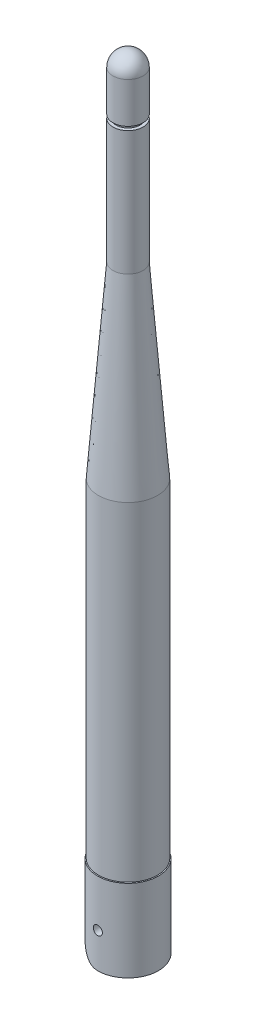
ISO-10303-21;
HEADER;
FILE_DESCRIPTION(('STEP AP214'),'2;1');
FILE_NAME('part.step','',(''),(''),'','','');
FILE_SCHEMA(('AUTOMOTIVE_DESIGN { 1 0 10303 214 1 1 1 1 }'));
ENDSEC;
DATA;
#1=APPLICATION_CONTEXT('core data for automotive mechanical design processes');
#2=APPLICATION_PROTOCOL_DEFINITION('international standard','automotive_design',2000,#1);
#3=PRODUCT_CONTEXT('',#1,'mechanical');
#4=PRODUCT('Part','Part','',(#3));
#5=PRODUCT_RELATED_PRODUCT_CATEGORY('part','',(#4));
#6=PRODUCT_DEFINITION_FORMATION('','',#4);
#7=PRODUCT_DEFINITION_CONTEXT('part definition',#1,'design');
#8=PRODUCT_DEFINITION('design','',#6,#7);
#9=PRODUCT_DEFINITION_SHAPE('','',#8);
#10=(LENGTH_UNIT() NAMED_UNIT(*) SI_UNIT(.MILLI.,.METRE.));
#11=(NAMED_UNIT(*) PLANE_ANGLE_UNIT() SI_UNIT($,.RADIAN.));
#12=(NAMED_UNIT(*) SI_UNIT($,.STERADIAN.) SOLID_ANGLE_UNIT());
#13=UNCERTAINTY_MEASURE_WITH_UNIT(LENGTH_MEASURE(1.E-05),#10,'distance_accuracy_value','');
#14=(GEOMETRIC_REPRESENTATION_CONTEXT(3) GLOBAL_UNCERTAINTY_ASSIGNED_CONTEXT((#13)) GLOBAL_UNIT_ASSIGNED_CONTEXT((#10,
#11,#12)) REPRESENTATION_CONTEXT('',''));
#15=CARTESIAN_POINT('',(0.,0.,0.));
#16=DIRECTION('',(0.,0.,1.));
#17=DIRECTION('',(1.,0.,0.));
#18=AXIS2_PLACEMENT_3D('',#15,#16,#17);
#19=CARTESIAN_POINT('',(6.73734999999998,169.81455,0.));
#20=DIRECTION('',(0.,-1.,0.));
#21=DIRECTION('',(1.,0.,0.));
#22=AXIS2_PLACEMENT_3D('',#19,#20,#21);
#23=SPHERICAL_SURFACE('',#22,3.33375000000006);
#24=CARTESIAN_POINT('',(6.73734999999998,169.81455,0.));
#25=DIRECTION('',(0.,-1.,0.));
#26=DIRECTION('',(1.,0.,0.));
#27=AXIS2_PLACEMENT_3D('',#24,#25,#26);
#28=CIRCLE('',#27,3.33375000000002);
#29=CARTESIAN_POINT('',(10.0711,169.81455,0.));
#30=VERTEX_POINT('',#29);
#31=EDGE_CURVE('E11',#30,#30,#28,.T.);
#32=ORIENTED_EDGE('',*,*,#31,.F.);
#33=EDGE_LOOP('',(#32));
#34=FACE_BOUND('',#33,.T.);
#35=ADVANCED_FACE('F47',(#34),#23,.T.);
#36=CARTESIAN_POINT('',(6.73735,18.1483,0.));
#37=DIRECTION('',(0.,-1.,0.));
#38=DIRECTION('',(1.,0.,0.));
#39=AXIS2_PLACEMENT_3D('',#36,#37,#38);
#40=CYLINDRICAL_SURFACE('',#39,3.33375000000002);
#41=ORIENTED_EDGE('',*,*,#31,.T.);
#42=EDGE_LOOP('',(#41));
#43=FACE_BOUND('',#42,.T.);
#44=CARTESIAN_POINT('',(6.73734999999998,160.8293,0.));
#45=DIRECTION('',(0.,-1.,0.));
#46=DIRECTION('',(1.,0.,0.));
#47=AXIS2_PLACEMENT_3D('',#44,#45,#46);
#48=CIRCLE('',#47,3.33375000000002);
#49=CARTESIAN_POINT('',(10.0711,160.8293,0.));
#50=VERTEX_POINT('',#49);
#51=EDGE_CURVE('E53',#50,#50,#48,.T.);
#52=ORIENTED_EDGE('',*,*,#51,.F.);
#53=EDGE_LOOP('',(#52));
#54=FACE_BOUND('',#53,.T.);
#55=ADVANCED_FACE('F101',(#43,#54),#40,.T.);
#56=CARTESIAN_POINT('',(10.0711,160.8293,0.));
#57=DIRECTION('',(0.,-1.,0.));
#58=DIRECTION('',(1.,0.,0.));
#59=AXIS2_PLACEMENT_3D('',#56,#57,#58);
#60=PLANE('',#59);
#61=ORIENTED_EDGE('',*,*,#51,.T.);
#62=EDGE_LOOP('',(#61));
#63=FACE_BOUND('',#62,.T.);
#64=CARTESIAN_POINT('',(6.73734999999998,160.8293,0.));
#65=DIRECTION('',(0.,-1.,0.));
#66=DIRECTION('',(1.,0.,0.));
#67=AXIS2_PLACEMENT_3D('',#64,#65,#66);
#68=CIRCLE('',#67,2.62890000000002);
#69=CARTESIAN_POINT('',(9.36625,160.8293,0.));
#70=VERTEX_POINT('',#69);
#71=EDGE_CURVE('E57',#70,#70,#68,.T.);
#72=ORIENTED_EDGE('',*,*,#71,.F.);
#73=EDGE_LOOP('',(#72));
#74=FACE_BOUND('',#73,.T.);
#75=ADVANCED_FACE('F106',(#63,#74),#60,.T.);
#76=CARTESIAN_POINT('',(6.73735,18.1483,0.));
#77=DIRECTION('',(0.,-1.,0.));
#78=DIRECTION('',(1.,0.,0.));
#79=AXIS2_PLACEMENT_3D('',#76,#77,#78);
#80=CYLINDRICAL_SURFACE('',#79,2.62890000000002);
#81=ORIENTED_EDGE('',*,*,#71,.T.);
#82=EDGE_LOOP('',(#81));
#83=FACE_BOUND('',#82,.T.);
#84=CARTESIAN_POINT('',(6.73734999999998,160.0165,0.));
#85=DIRECTION('',(0.,-1.,0.));
#86=DIRECTION('',(1.,0.,0.));
#87=AXIS2_PLACEMENT_3D('',#84,#85,#86);
#88=CIRCLE('',#87,2.62890000000002);
#89=CARTESIAN_POINT('',(9.36625,160.0165,0.));
#90=VERTEX_POINT('',#89);
#91=EDGE_CURVE('E61',#90,#90,#88,.T.);
#92=ORIENTED_EDGE('',*,*,#91,.F.);
#93=EDGE_LOOP('',(#92));
#94=FACE_BOUND('',#93,.T.);
#95=ADVANCED_FACE('F110',(#83,#94),#80,.T.);
#96=CARTESIAN_POINT('',(9.36625,160.0165,0.));
#97=DIRECTION('',(0.,1.,0.));
#98=DIRECTION('',(-1.,0.,0.));
#99=AXIS2_PLACEMENT_3D('',#96,#97,#98);
#100=PLANE('',#99);
#101=ORIENTED_EDGE('',*,*,#91,.T.);
#102=EDGE_LOOP('',(#101));
#103=FACE_BOUND('',#102,.T.);
#104=CARTESIAN_POINT('',(6.73734999999998,160.0165,0.));
#105=DIRECTION('',(0.,-1.,0.));
#106=DIRECTION('',(1.,0.,0.));
#107=AXIS2_PLACEMENT_3D('',#104,#105,#106);
#108=CIRCLE('',#107,3.33375000000002);
#109=CARTESIAN_POINT('',(10.0711,160.0165,0.));
#110=VERTEX_POINT('',#109);
#111=EDGE_CURVE('E66',#110,#110,#108,.T.);
#112=ORIENTED_EDGE('',*,*,#111,.F.);
#113=EDGE_LOOP('',(#112));
#114=FACE_BOUND('',#113,.T.);
#115=ADVANCED_FACE('F116',(#103,#114),#100,.T.);
#116=CARTESIAN_POINT('',(6.73735,18.1483,0.));
#117=DIRECTION('',(0.,-1.,0.));
#118=DIRECTION('',(1.,0.,0.));
#119=AXIS2_PLACEMENT_3D('',#116,#117,#118);
#120=CYLINDRICAL_SURFACE('',#119,3.33375000000002);
#121=ORIENTED_EDGE('',*,*,#111,.T.);
#122=EDGE_LOOP('',(#121));
#123=FACE_BOUND('',#122,.T.);
#124=CARTESIAN_POINT('',(6.73734999999999,132.5083,0.));
#125=DIRECTION('',(0.,-1.,0.));
#126=DIRECTION('',(1.,0.,0.));
#127=AXIS2_PLACEMENT_3D('',#124,#125,#126);
#128=CIRCLE('',#127,3.33375000000002);
#129=CARTESIAN_POINT('',(10.0711,132.5083,0.));
#130=VERTEX_POINT('',#129);
#131=EDGE_CURVE('E69',#130,#130,#128,.T.);
#132=ORIENTED_EDGE('',*,*,#131,.F.);
#133=EDGE_LOOP('',(#132));
#134=FACE_BOUND('',#133,.T.);
#135=ADVANCED_FACE('F120',(#123,#134),#120,.T.);
#136=CARTESIAN_POINT('',(6.73734999999999,90.9955,0.));
#137=DIRECTION('',(0.,-1.,0.));
#138=DIRECTION('',(1.,0.,0.));
#139=AXIS2_PLACEMENT_3D('',#136,#137,#138);
#140=CONICAL_SURFACE('',#139,6.54050000000001,0.0770941580717803);
#141=ORIENTED_EDGE('',*,*,#131,.T.);
#142=EDGE_LOOP('',(#141));
#143=FACE_BOUND('',#142,.T.);
#144=CARTESIAN_POINT('',(6.73734999999999,90.9955,0.));
#145=DIRECTION('',(0.,-1.,0.));
#146=DIRECTION('',(1.,0.,0.));
#147=AXIS2_PLACEMENT_3D('',#144,#145,#146);
#148=CIRCLE('',#147,6.54050000000001);
#149=CARTESIAN_POINT('',(13.27785,90.9955,0.));
#150=VERTEX_POINT('',#149);
#151=EDGE_CURVE('E72',#150,#150,#148,.T.);
#152=ORIENTED_EDGE('',*,*,#151,.F.);
#153=EDGE_LOOP('',(#152));
#154=FACE_BOUND('',#153,.T.);
#155=ADVANCED_FACE('F124',(#143,#154),#140,.T.);
#156=CARTESIAN_POINT('',(6.73735,18.1483,0.));
#157=DIRECTION('',(0.,-1.,0.));
#158=DIRECTION('',(1.,0.,0.));
#159=AXIS2_PLACEMENT_3D('',#156,#157,#158);
#160=CYLINDRICAL_SURFACE('',#159,6.54050000000001);
#161=ORIENTED_EDGE('',*,*,#151,.T.);
#162=EDGE_LOOP('',(#161));
#163=FACE_BOUND('',#162,.T.);
#164=CARTESIAN_POINT('',(6.73735,18.2245,0.));
#165=DIRECTION('',(0.,-1.,0.));
#166=DIRECTION('',(1.,0.,0.));
#167=AXIS2_PLACEMENT_3D('',#164,#165,#166);
#168=CIRCLE('',#167,6.5405);
#169=CARTESIAN_POINT('',(13.27785,18.2245,0.));
#170=VERTEX_POINT('',#169);
#171=EDGE_CURVE('E75',#170,#170,#168,.T.);
#172=ORIENTED_EDGE('',*,*,#171,.F.);
#173=EDGE_LOOP('',(#172));
#174=FACE_BOUND('',#173,.T.);
#175=ADVANCED_FACE('F97',(#163,#174),#160,.T.);
#176=CARTESIAN_POINT('',(13.27785,18.2245,0.));
#177=DIRECTION('',(0.,-1.,0.));
#178=DIRECTION('',(1.,0.,0.));
#179=AXIS2_PLACEMENT_3D('',#176,#177,#178);
#180=PLANE('',#179);
#181=ORIENTED_EDGE('',*,*,#171,.T.);
#182=EDGE_LOOP('',(#181));
#183=FACE_BOUND('',#182,.T.);
#184=CARTESIAN_POINT('',(6.73735,18.2245,0.));
#185=DIRECTION('',(0.,-1.,0.));
#186=DIRECTION('',(1.,0.,0.));
#187=AXIS2_PLACEMENT_3D('',#184,#185,#186);
#188=CIRCLE('',#187,1.42875);
#189=CARTESIAN_POINT('',(8.1661,18.2245,0.));
#190=VERTEX_POINT('',#189);
#191=EDGE_CURVE('E78',#190,#190,#188,.T.);
#192=ORIENTED_EDGE('',*,*,#191,.F.);
#193=EDGE_LOOP('',(#192));
#194=FACE_BOUND('',#193,.T.);
#195=ADVANCED_FACE('F89',(#183,#194),#180,.T.);
#196=CARTESIAN_POINT('',(6.73735,18.1483,0.));
#197=DIRECTION('',(0.,-1.,0.));
#198=DIRECTION('',(1.,0.,0.));
#199=AXIS2_PLACEMENT_3D('',#196,#197,#198);
#200=CYLINDRICAL_SURFACE('',#199,1.42875000000001);
#201=ORIENTED_EDGE('',*,*,#191,.T.);
#202=EDGE_LOOP('',(#201));
#203=FACE_BOUND('',#202,.T.);
#204=CARTESIAN_POINT('',(6.73734999999998,169.81455,0.));
#205=DIRECTION('',(0.,-1.,0.));
#206=DIRECTION('',(1.,0.,0.));
#207=AXIS2_PLACEMENT_3D('',#204,#205,#206);
#208=CIRCLE('',#207,1.42875000000002);
#209=CARTESIAN_POINT('',(8.1661,169.81455,0.));
#210=VERTEX_POINT('',#209);
#211=EDGE_CURVE('E81',#210,#210,#208,.T.);
#212=ORIENTED_EDGE('',*,*,#211,.F.);
#213=EDGE_LOOP('',(#212));
#214=FACE_BOUND('',#213,.T.);
#215=ADVANCED_FACE('F87',(#203,#214),#200,.F.);
#216=CARTESIAN_POINT('',(6.73734999999998,169.81455,0.));
#217=DIRECTION('',(0.,-1.,0.));
#218=DIRECTION('',(1.,0.,0.));
#219=AXIS2_PLACEMENT_3D('',#216,#217,#218);
#220=PLANE('',#219);
#221=ORIENTED_EDGE('',*,*,#211,.T.);
#222=EDGE_LOOP('',(#221));
#223=FACE_BOUND('',#222,.T.);
#224=ADVANCED_FACE('F85',(#223),#220,.T.);
#225=CLOSED_SHELL('',(#35,#55,#75,#95,#115,#135,#155,#175,#195,#215,#224));
#226=MANIFOLD_SOLID_BREP('B2',#225);
#227=CARTESIAN_POINT('',(10.9347,13.7033,-4.43865));
#228=DIRECTION('',(0.,0.,1.));
#229=DIRECTION('',(0.,-1.,0.));
#230=AXIS2_PLACEMENT_3D('',#227,#228,#229);
#231=PLANE('',#230);
#232=CARTESIAN_POINT('',(6.73735,7.747,-4.43865));
#233=DIRECTION('',(0.,0.,1.));
#234=DIRECTION('',(0.,-1.,0.));
#235=AXIS2_PLACEMENT_3D('',#232,#233,#234);
#236=CIRCLE('',#235,1.);
#237=CARTESIAN_POINT('',(6.73735,6.747,-4.43865));
#238=VERTEX_POINT('',#237);
#239=EDGE_CURVE('E333',#238,#238,#236,.F.);
#240=ORIENTED_EDGE('',*,*,#239,.T.);
#241=EDGE_LOOP('',(#240));
#242=FACE_BOUND('',#241,.T.);
#243=DIRECTION('',(0.,-1.,0.));
#244=VECTOR('',#243,1.);
#245=CARTESIAN_POINT('',(1.6688054,13.7033,-4.43865));
#246=LINE('',#245,#244);
#247=CARTESIAN_POINT('',(1.6688054,5.0685446,-4.43865714392927));
#248=VERTEX_POINT('',#247);
#249=CARTESIAN_POINT('',(1.6688054,0.,-4.43865714392927));
#250=VERTEX_POINT('',#249);
#251=EDGE_CURVE('E378',#248,#250,#246,.T.);
#252=ORIENTED_EDGE('',*,*,#251,.F.);
#253=CARTESIAN_POINT('',(6.73735,5.0685446,-4.43865));
#254=DIRECTION('',(0.,0.,1.));
#255=DIRECTION('',(0.,-1.,0.));
#256=AXIS2_PLACEMENT_3D('',#253,#254,#255);
#257=CIRCLE('',#256,5.0685446);
#258=CARTESIAN_POINT('',(6.73735,0.,-4.43865));
#259=VERTEX_POINT('',#258);
#260=EDGE_CURVE('E322',#259,#248,#257,.F.);
#261=ORIENTED_EDGE('',*,*,#260,.F.);
#262=DIRECTION('',(-1.,0.,0.));
#263=VECTOR('',#262,1.);
#264=CARTESIAN_POINT('',(10.9347,0.,-4.43865));
#265=LINE('',#264,#263);
#266=CARTESIAN_POINT('',(10.9347,0.,-4.43865));
#267=VERTEX_POINT('',#266);
#268=EDGE_CURVE('E480',#267,#259,#265,.T.);
#269=ORIENTED_EDGE('',*,*,#268,.F.);
#270=DIRECTION('',(0.,1.,0.));
#271=VECTOR('',#270,1.);
#272=CARTESIAN_POINT('',(10.9347,13.7033,-4.43865));
#273=LINE('',#272,#271);
#274=CARTESIAN_POINT('',(10.9347,13.7033,-4.43865));
#275=VERTEX_POINT('',#274);
#276=EDGE_CURVE('E469',#267,#275,#273,.T.);
#277=ORIENTED_EDGE('',*,*,#276,.T.);
#278=DIRECTION('',(-1.,0.,0.));
#279=VECTOR('',#278,1.);
#280=CARTESIAN_POINT('',(10.9347,13.7033,-4.43865));
#281=LINE('',#280,#279);
#282=CARTESIAN_POINT('',(1.6891,13.7033,-4.43865));
#283=VERTEX_POINT('',#282);
#284=EDGE_CURVE('E487',#275,#283,#281,.T.);
#285=ORIENTED_EDGE('',*,*,#284,.T.);
#286=DIRECTION('',(1.,0.,0.));
#287=VECTOR('',#286,1.);
#288=CARTESIAN_POINT('',(10.9347,13.7033,-4.43865));
#289=LINE('',#288,#287);
#290=CARTESIAN_POINT('',(1.66879288776381,13.7033,-4.43865));
#291=VERTEX_POINT('',#290);
#292=EDGE_CURVE('E434',#291,#283,#289,.T.);
#293=ORIENTED_EDGE('',*,*,#292,.F.);
#294=DIRECTION('',(0.,-1.,0.));
#295=VECTOR('',#294,1.);
#296=CARTESIAN_POINT('',(1.66879288776381,18.1483,-4.43864999999999));
#297=LINE('',#296,#295);
#298=EDGE_CURVE('E327',#291,#250,#297,.T.);
#299=ORIENTED_EDGE('',*,*,#298,.T.);
#300=EDGE_LOOP('',(#252,#261,#269,#277,#285,#293,#299));
#301=FACE_BOUND('',#300,.T.);
#302=ADVANCED_FACE('F208',(#242,#301),#231,.T.);
#303=CARTESIAN_POINT('',(10.9347,13.7033,4.43865));
#304=DIRECTION('',(0.,0.,-1.));
#305=DIRECTION('',(0.,1.,0.));
#306=AXIS2_PLACEMENT_3D('',#303,#304,#305);
#307=PLANE('',#306);
#308=CARTESIAN_POINT('',(6.73735,7.747,4.43865));
#309=DIRECTION('',(0.,0.,-1.));
#310=DIRECTION('',(0.,1.,0.));
#311=AXIS2_PLACEMENT_3D('',#308,#309,#310);
#312=CIRCLE('',#311,1.);
#313=CARTESIAN_POINT('',(6.73735,8.747,4.43865));
#314=VERTEX_POINT('',#313);
#315=EDGE_CURVE('E489',#314,#314,#312,.F.);
#316=ORIENTED_EDGE('',*,*,#315,.T.);
#317=EDGE_LOOP('',(#316));
#318=FACE_BOUND('',#317,.T.);
#319=DIRECTION('',(0.,1.,0.));
#320=VECTOR('',#319,1.);
#321=CARTESIAN_POINT('',(1.6688054,13.7033,4.43865));
#322=LINE('',#321,#320);
#323=CARTESIAN_POINT('',(1.6688054,0.,4.43865714392928));
#324=VERTEX_POINT('',#323);
#325=CARTESIAN_POINT('',(1.6688054,5.0685446,4.43865357196464));
#326=VERTEX_POINT('',#325);
#327=EDGE_CURVE('E45',#324,#326,#322,.T.);
#328=ORIENTED_EDGE('',*,*,#327,.F.);
#329=DIRECTION('',(0.,-1.,0.));
#330=VECTOR('',#329,1.);
#331=CARTESIAN_POINT('',(1.66879288776382,18.1483,4.43865000000001));
#332=LINE('',#331,#330);
#333=CARTESIAN_POINT('',(1.66879288776381,13.7033,4.43865));
#334=VERTEX_POINT('',#333);
#335=EDGE_CURVE('E420',#324,#334,#332,.F.);
#336=ORIENTED_EDGE('',*,*,#335,.T.);
#337=DIRECTION('',(-1.,0.,0.));
#338=VECTOR('',#337,1.);
#339=CARTESIAN_POINT('',(10.9347,13.7033,4.43865));
#340=LINE('',#339,#338);
#341=CARTESIAN_POINT('',(1.6891,13.7033,4.43865));
#342=VERTEX_POINT('',#341);
#343=EDGE_CURVE('E484',#342,#334,#340,.T.);
#344=ORIENTED_EDGE('',*,*,#343,.F.);
#345=CARTESIAN_POINT('',(10.9347,13.7033,4.43865));
#346=VERTEX_POINT('',#345);
#347=EDGE_CURVE('E485',#346,#342,#340,.T.);
#348=ORIENTED_EDGE('',*,*,#347,.F.);
#349=DIRECTION('',(0.,-1.,0.));
#350=VECTOR('',#349,1.);
#351=CARTESIAN_POINT('',(10.9347,13.7033,4.43865));
#352=LINE('',#351,#350);
#353=CARTESIAN_POINT('',(10.9347,0.,4.43865));
#354=VERTEX_POINT('',#353);
#355=EDGE_CURVE('E476',#346,#354,#352,.T.);
#356=ORIENTED_EDGE('',*,*,#355,.T.);
#357=DIRECTION('',(-1.,0.,0.));
#358=VECTOR('',#357,1.);
#359=CARTESIAN_POINT('',(10.9347,0.,4.43865));
#360=LINE('',#359,#358);
#361=CARTESIAN_POINT('',(6.73735,0.,4.43865));
#362=VERTEX_POINT('',#361);
#363=EDGE_CURVE('E482',#354,#362,#360,.T.);
#364=ORIENTED_EDGE('',*,*,#363,.T.);
#365=CARTESIAN_POINT('',(6.73735,5.0685446,4.43865));
#366=DIRECTION('',(0.,0.,-1.));
#367=DIRECTION('',(0.,1.,0.));
#368=AXIS2_PLACEMENT_3D('',#365,#366,#367);
#369=CIRCLE('',#368,5.0685446);
#370=EDGE_CURVE('E213',#326,#362,#369,.F.);
#371=ORIENTED_EDGE('',*,*,#370,.F.);
#372=EDGE_LOOP('',(#328,#336,#344,#348,#356,#364,#371));
#373=FACE_BOUND('',#372,.T.);
#374=ADVANCED_FACE('F365',(#318,#373),#307,.T.);
#375=CARTESIAN_POINT('',(6.73735,18.1483,0.));
#376=DIRECTION('',(0.,-1.,0.));
#377=DIRECTION('',(0.,0.,-1.));
#378=AXIS2_PLACEMENT_3D('',#375,#376,#377);
#379=CYLINDRICAL_SURFACE('',#378,6.73735);
#380=CARTESIAN_POINT('',(6.73735,8.747,-6.73735));
#381=CARTESIAN_POINT('',(6.68150868120806,8.74699769193625,-6.73734911157208));
#382=CARTESIAN_POINT('',(6.62563479010939,8.74230683142806,-6.73664847429251));
#383=CARTESIAN_POINT('',(6.51544829056303,8.72367180945636,-6.73392092187784));
#384=CARTESIAN_POINT('',(6.46113726412752,8.7097185937027,-6.73189270901627));
#385=CARTESIAN_POINT('',(6.35568709667808,8.67298457157395,-6.72673796924256));
#386=CARTESIAN_POINT('',(6.3045456093573,8.65021038785015,-6.72361226647367));
#387=CARTESIAN_POINT('',(6.20681805847655,8.59649697819284,-6.71660808887162));
#388=CARTESIAN_POINT('',(6.16023135345841,8.56555890427128,-6.71272972026806));
#389=CARTESIAN_POINT('',(6.07257120885602,8.49614352189278,-6.70461841478345));
#390=CARTESIAN_POINT('',(6.03153768863242,8.45761605893373,-6.70038323268382));
#391=CARTESIAN_POINT('',(5.95649308102526,8.37422346790708,-6.69205324066081));
#392=CARTESIAN_POINT('',(5.92248239424449,8.32935797854577,-6.68795843875623));
#393=CARTESIAN_POINT('',(5.86229392894297,8.23429525333748,-6.68035103219009));
#394=CARTESIAN_POINT('',(5.83615469408335,8.18407336146975,-6.67684132876701));
#395=CARTESIAN_POINT('',(5.79269743425183,8.07989133558924,-6.67083209129719));
#396=CARTESIAN_POINT('',(5.77537893862514,8.02593140120456,-6.66833250335443));
#397=CARTESIAN_POINT('',(5.75017856896727,7.91622450501637,-6.6646485443508));
#398=CARTESIAN_POINT('',(5.74222841057347,7.86049355380698,-6.66345466086402));
#399=CARTESIAN_POINT('',(5.73577886905402,7.7484767921507,-6.66248839312649));
#400=CARTESIAN_POINT('',(5.73727895446179,7.69219101308417,-6.6627159289374));
#401=CARTESIAN_POINT('',(5.74963149852189,7.58114426779082,-6.66455809205531));
#402=CARTESIAN_POINT('',(5.76040796231961,7.52637463420617,-6.66616144789944));
#403=CARTESIAN_POINT('',(5.79088842328847,7.41942965607051,-6.67055698772443));
#404=CARTESIAN_POINT('',(5.81059266818134,7.36725438355057,-6.67334920469284));
#405=CARTESIAN_POINT('',(5.85844857903808,7.26674764228807,-6.67982032708185));
#406=CARTESIAN_POINT('',(5.886632491027,7.21843175350106,-6.683502606484));
#407=CARTESIAN_POINT('',(5.95062472657551,7.1271862828525,-6.69133650380724));
#408=CARTESIAN_POINT('',(5.98643354024875,7.08425704751644,-6.69548815189037));
#409=CARTESIAN_POINT('',(6.06507651945458,7.00456300439116,-6.70384282247055));
#410=CARTESIAN_POINT('',(6.10797603428026,6.96786266436383,-6.70804594999719));
#411=CARTESIAN_POINT('',(6.19935977386531,6.90217279058705,-6.71599222540868));
#412=CARTESIAN_POINT('',(6.24784402216477,6.87318328934111,-6.71973537135455));
#413=CARTESIAN_POINT('',(6.3490763992043,6.82373490616064,-6.72634372623456));
#414=CARTESIAN_POINT('',(6.40182696143048,6.80328093440909,-6.72920842958173));
#415=CARTESIAN_POINT('',(6.51006625567525,6.77153993763208,-6.7337328766834));
#416=CARTESIAN_POINT('',(6.56555480622293,6.76025230593491,-6.73539270018177));
#417=CARTESIAN_POINT('',(6.6771384889879,6.74724998064012,-6.73730982238818));
#418=CARTESIAN_POINT('',(6.73322307729234,6.74544664492184,-6.7375801074613));
#419=CARTESIAN_POINT('',(6.84489385297204,6.75122891009072,-6.73672302956754));
#420=CARTESIAN_POINT('',(6.90048005539381,6.7588142265621,-6.73559570893912));
#421=CARTESIAN_POINT('',(7.00930814523467,6.78308477091354,-6.73207812117847));
#422=CARTESIAN_POINT('',(7.06255985998624,6.79972687551473,-6.72969384064472));
#423=CARTESIAN_POINT('',(7.16551716030133,6.84159315607807,-6.72392883713762));
#424=CARTESIAN_POINT('',(7.21522258222134,6.8668177277683,-6.72054806821825));
#425=CARTESIAN_POINT('',(7.31006653887681,6.92534131141802,-6.71313358447621));
#426=CARTESIAN_POINT('',(7.35516997361158,6.95869662821242,-6.70909538473037));
#427=CARTESIAN_POINT('',(7.4391704891989,7.03245639057111,-6.70082963894724));
#428=CARTESIAN_POINT('',(7.47806721703667,7.07286123681344,-6.69660208215753));
#429=CARTESIAN_POINT('',(7.5488721764603,7.15996745575126,-6.68839299051386));
#430=CARTESIAN_POINT('',(7.58072103143942,7.20671734056407,-6.68441373479973));
#431=CARTESIAN_POINT('',(7.63611362493716,7.30495540283232,-6.67719196706977));
#432=CARTESIAN_POINT('',(7.65965758414521,7.35644345433264,-6.67394943547749));
#433=CARTESIAN_POINT('',(7.69767975261397,7.46251825161195,-6.6685846841978));
#434=CARTESIAN_POINT('',(7.71218935958488,7.51709353833071,-6.66645858856573));
#435=CARTESIAN_POINT('',(7.7318309647736,7.62794018803837,-6.66355707373742));
#436=CARTESIAN_POINT('',(7.73696359590559,7.68421143629499,-6.66278156338142));
#437=CARTESIAN_POINT('',(7.73769072974659,7.7962609322353,-6.66267237980856));
#438=CARTESIAN_POINT('',(7.73337858629166,7.85203858283225,-6.66332459466525));
#439=CARTESIAN_POINT('',(7.71553846827322,7.96206612107907,-6.66596672623093));
#440=CARTESIAN_POINT('',(7.70201050726104,8.0163160109753,-6.66795664097291));
#441=CARTESIAN_POINT('',(7.6661555213279,8.12172311809624,-6.67304506401254));
#442=CARTESIAN_POINT('',(7.64383488512152,8.17288254977368,-6.67614276724622));
#443=CARTESIAN_POINT('',(7.59103742439038,8.27074550417748,-6.68309873573338));
#444=CARTESIAN_POINT('',(7.5605603353359,8.31744888231865,-6.68695702565312));
#445=CARTESIAN_POINT('',(7.49197542794159,8.40554850520352,-6.69504485883021));
#446=CARTESIAN_POINT('',(7.45379843365836,8.44689061342481,-6.69927755687675));
#447=CARTESIAN_POINT('',(7.37104357403032,8.52261491319743,-6.70761084600819));
#448=CARTESIAN_POINT('',(7.32646422174312,8.55699548345472,-6.71171140613255));
#449=CARTESIAN_POINT('',(7.23188812443315,8.61798568640545,-6.71934356833502));
#450=CARTESIAN_POINT('',(7.18186350827151,8.64455249013305,-6.72287198875773));
#451=CARTESIAN_POINT('',(7.07803370180657,8.68886735091421,-6.7289310671514));
#452=CARTESIAN_POINT('',(7.0242325069654,8.70662457229201,-6.73146276141588));
#453=CARTESIAN_POINT('',(6.93138115066817,8.72877255609841,-6.7346630172018));
#454=CARTESIAN_POINT('',(6.89290503241627,8.73559744428148,-6.73566547905452));
#455=CARTESIAN_POINT('',(6.81540791106132,8.74471194567793,-6.73700927700976));
#456=CARTESIAN_POINT('',(6.77638691452424,8.74700161349498,-6.73735062107209));
#457=CARTESIAN_POINT('',(6.73735,8.747,-6.73735));
#458=B_SPLINE_CURVE_WITH_KNOTS('',3,(#380,#381,#382,#383,#384,#385,#386,#387,#388,#389,#390,
#391,#392,#393,#394,#395,#396,#397,#398,#399,#400,#401,#402,#403,#404,#405,#406,#407,#408,#409,
#410,#411,#412,#413,#414,#415,#416,#417,#418,#419,#420,#421,#422,#423,#424,#425,#426,#427,#428,
#429,#430,#431,#432,#433,#434,#435,#436,#437,#438,#439,#440,#441,#442,#443,#444,#445,#446,#447,
#448,#449,#450,#451,#452,#453,#454,#455,#456,#457),.UNSPECIFIED.,.T.,.F.,(4,2,2,2,2,2,2,2,2,2,2,
2,2,2,2,2,2,2,2,2,2,2,2,2,2,2,2,2,2,2,2,2,2,2,2,2,2,2,4),(0.,0.167381315113997,
0.334926492993973,0.502346123523177,0.669742141978975,0.838283939484181,1.0068353484483,
1.17619915234875,1.34555391843092,1.51366649465846,1.68176961658803,1.8485085537111,
2.01525211767128,2.18263795630793,2.35003455742585,2.51907005496194,2.68810626502218,
2.85723958192787,3.02636170387884,3.19390033106385,3.36143388303035,3.52817662715993,
3.69492706065558,3.8628667795433,4.03081604682599,4.20013050318056,4.36944045993287,
4.53815866879639,4.70686548933041,4.8739123130072,5.04095889105183,5.20788431708942,
5.37481515750144,5.54331846042493,5.71186096157945,5.88131076374088,6.05058392117773,
6.16759635754684,6.28460738508733),.UNSPECIFIED.);
#459=CARTESIAN_POINT('',(6.73735,8.747,-6.73735));
#460=VERTEX_POINT('',#459);
#461=EDGE_CURVE('E343',#460,#460,#458,.T.);
#462=ORIENTED_EDGE('',*,*,#461,.T.);
#463=EDGE_LOOP('',(#462));
#464=FACE_BOUND('',#463,.T.);
#465=CARTESIAN_POINT('',(7.73735,7.747,6.66272354390455));
#466=CARTESIAN_POINT('',(7.73734768866178,7.69116250060757,6.66272446973448));
#467=CARTESIAN_POINT('',(7.73265744816043,7.6352924185826,6.66343306460602));
#468=CARTESIAN_POINT('',(7.71402511238573,7.52511383161168,6.66618901913815));
#469=CARTESIAN_POINT('',(7.70007394905722,7.47080691170708,6.66823769093853));
#470=CARTESIAN_POINT('',(7.6633459293726,7.3653654330088,6.67343676596923));
#471=CARTESIAN_POINT('',(7.64057579274054,7.31422849314276,6.67658633018341));
#472=CARTESIAN_POINT('',(7.58687191763933,7.21650858137392,6.68363131606497));
#473=CARTESIAN_POINT('',(7.55593932146686,7.16992497350346,6.68752663334689));
#474=CARTESIAN_POINT('',(7.48652950631045,7.08226141233671,6.69565837633766));
#475=CARTESIAN_POINT('',(7.44800090608359,7.04122234044308,6.69989700234292));
#476=CARTESIAN_POINT('',(7.36460369879933,6.96616699490567,6.70821812842603));
#477=CARTESIAN_POINT('',(7.31973474570841,6.93215110481131,6.71230061996718));
#478=CARTESIAN_POINT('',(7.22466890565573,6.8719571339402,6.71987248065775));
#479=CARTESIAN_POINT('',(7.17444795862732,6.84581665879386,6.72335897067118));
#480=CARTESIAN_POINT('',(7.07026798350175,6.80235684640455,6.72932163729203));
#481=CARTESIAN_POINT('',(7.01630914904586,6.78503705259382,6.73179786619033));
#482=CARTESIAN_POINT('',(6.90660594760986,6.75983406513471,6.73544548580199));
#483=CARTESIAN_POINT('',(6.8508776211273,6.75188244157378,6.73662633421016));
#484=CARTESIAN_POINT('',(6.73886602286099,6.7454290599333,6.73758254980594));
#485=CARTESIAN_POINT('',(6.68258278148041,6.74692678697564,6.73735799357152));
#486=CARTESIAN_POINT('',(6.57152581003524,6.75927553227758,6.73553626451045));
#487=CARTESIAN_POINT('',(6.51674369177966,6.77005293231009,6.73394989561897));
#488=CARTESIAN_POINT('',(6.40977423028893,6.80053956810802,6.72959482707201));
#489=CARTESIAN_POINT('',(6.35758695273795,6.82024902984642,6.72682609750399));
#490=CARTESIAN_POINT('',(6.25706540791859,6.86811587365351,6.72039882824008));
#491=CARTESIAN_POINT('',(6.2087461435199,6.89630430643049,6.71673702753022));
#492=CARTESIAN_POINT('',(6.1174958257116,6.96030626169382,6.7089318289202));
#493=CARTESIAN_POINT('',(6.07456511997116,6.9961202757802,6.70478839997864));
#494=CARTESIAN_POINT('',(5.9948767069033,7.07476702655577,6.69643504303983));
#495=CARTESIAN_POINT('',(5.95818242492095,7.11766403055393,6.69222485890185));
#496=CARTESIAN_POINT('',(5.89250358953076,7.20904055921618,6.68425145839504));
#497=CARTESIAN_POINT('',(5.86351908174114,7.25752011690942,6.68048824467099));
#498=CARTESIAN_POINT('',(5.81407432608676,7.35875105382467,6.67383495014));
#499=CARTESIAN_POINT('',(5.7936204996516,7.41150561549033,6.6709455275233));
#500=CARTESIAN_POINT('',(5.76188101118484,7.51975362780029,6.66637868893762));
#501=CARTESIAN_POINT('',(5.75059471716823,7.57524688936618,6.6647011894228));
#502=CARTESIAN_POINT('',(5.73759745254318,7.68683302852529,6.66276393795046));
#503=CARTESIAN_POINT('',(5.73579661655952,7.74291521591467,6.66249088086766));
#504=CARTESIAN_POINT('',(5.74158302431644,7.85458059577997,6.66335811574058));
#505=CARTESIAN_POINT('',(5.74916998304415,7.91016380335327,6.66449836478841));
#506=CARTESIAN_POINT('',(5.7734404336351,8.0189756340453,6.66805151781341));
#507=CARTESIAN_POINT('',(5.79007923962445,8.07221444639518,6.67045816810551));
#508=CARTESIAN_POINT('',(5.83193461963757,8.17514739492332,6.67626780336771));
#509=CARTESIAN_POINT('',(5.8571516091349,8.22484135927025,6.67967083659525));
#510=CARTESIAN_POINT('',(5.91566379373778,8.31967707756858,6.68712118344514));
#511=CARTESIAN_POINT('',(5.94901721310806,8.36478254300592,6.69117306501213));
#512=CARTESIAN_POINT('',(6.02277444310651,8.44878803495344,6.6994507666678));
#513=CARTESIAN_POINT('',(6.06317864381973,8.48768771790016,6.70367659637028));
#514=CARTESIAN_POINT('',(6.15028605788172,8.55849968206363,6.71186758483956));
#515=CARTESIAN_POINT('',(6.1970379171605,8.59035244197201,6.71583033887309));
#516=CARTESIAN_POINT('',(6.29528102905974,8.64575187901159,6.72301141018993));
#517=CARTESIAN_POINT('',(6.34677215418986,8.6692987794953,6.72622974749052));
#518=CARTESIAN_POINT('',(6.45284551044313,8.70732276607837,6.73154882051141));
#519=CARTESIAN_POINT('',(6.50741582030838,8.72183252195208,6.73365357768033));
#520=CARTESIAN_POINT('',(6.61825192361401,8.74147610908465,6.73652521009609));
#521=CARTESIAN_POINT('',(6.67451760727456,8.74661054609897,6.73729217178006));
#522=CARTESIAN_POINT('',(6.78656972937965,8.74734319902079,6.73740096262361));
#523=CARTESIAN_POINT('',(6.84235558026331,8.74303253449768,6.73675640910272));
#524=CARTESIAN_POINT('',(6.95239990201453,8.72519250036149,6.73414202338458));
#525=CARTESIAN_POINT('',(7.00665837747286,8.71166315845969,6.7321721951711));
#526=CARTESIAN_POINT('',(7.11208360645351,8.67580189906259,6.72712756413353));
#527=CARTESIAN_POINT('',(7.16325250124647,8.6534761606823,6.72405353709832));
#528=CARTESIAN_POINT('',(7.26113227080039,8.60066554775049,6.71713833435152));
#529=CARTESIAN_POINT('',(7.30784300685667,8.57018041945175,6.71329713478272));
#530=CARTESIAN_POINT('',(7.39594292440224,8.50158636742039,6.70523065647926));
#531=CARTESIAN_POINT('',(7.43727940372707,8.46341012478432,6.70100217997685));
#532=CARTESIAN_POINT('',(7.51299269601047,8.38065912473603,6.69266151113066));
#533=CARTESIAN_POINT('',(7.5473678725594,8.33608286705628,6.68854934632355));
#534=CARTESIAN_POINT('',(7.60835190965988,8.24150958243865,6.68088267762983));
#535=CARTESIAN_POINT('',(7.63491706296098,8.1914841183602,6.67733136176722));
#536=CARTESIAN_POINT('',(7.67922860716392,8.0876525812397,6.67122585362918));
#537=CARTESIAN_POINT('',(7.69698418005028,8.03385051151819,6.66867062375863));
#538=CARTESIAN_POINT('',(7.71912778126864,7.94100350558857,6.66543901288928));
#539=CARTESIAN_POINT('',(7.72595070123671,7.90253291643378,6.66442608853079));
#540=CARTESIAN_POINT('',(7.73506258999192,7.82504685385828,6.66306803464214));
#541=CARTESIAN_POINT('',(7.73735161566578,7.78603138728034,6.66272289673326));
#542=CARTESIAN_POINT('',(7.73735,7.747,6.66272354390455));
#543=B_SPLINE_CURVE_WITH_KNOTS('',3,(#465,#466,#467,#468,#469,#470,#471,#472,#473,#474,#475,
#476,#477,#478,#479,#480,#481,#482,#483,#484,#485,#486,#487,#488,#489,#490,#491,#492,#493,#494,
#495,#496,#497,#498,#499,#500,#501,#502,#503,#504,#505,#506,#507,#508,#509,#510,#511,#512,#513,
#514,#515,#516,#517,#518,#519,#520,#521,#522,#523,#524,#525,#526,#527,#528,#529,#530,#531,#532,
#533,#534,#535,#536,#537,#538,#539,#540,#541,#542),.UNSPECIFIED.,.T.,.F.,(4,2,2,2,2,2,2,2,2,2,2,
2,2,2,2,2,2,2,2,2,2,2,2,2,2,2,2,2,2,2,2,2,2,2,2,2,2,2,4),(0.,0.167369839362714,
0.334903805146491,0.502310366732971,0.669693512995027,0.838250332132522,1.00681635404733,
1.1761749775373,1.34552483395548,1.51362984793971,1.68172570226357,1.84850016489497,
2.01527884700294,2.18267588038467,2.35008370865689,2.5191036291087,2.68812454961742,
2.85727247118274,3.02640873115599,3.19393967119103,3.3614655251219,3.52817176831406,
3.69488608686385,3.8628303359873,4.03078387958755,4.20010602794588,4.36942362272273,
4.53812551724814,4.70681651126837,4.87388726674948,5.04095752001914,5.20791062179253,
5.37486891621023,5.54335756026843,5.71188576548521,5.88133989629714,6.0506170367314,
6.16761294552486,6.28460738636294),.UNSPECIFIED.);
#544=CARTESIAN_POINT('',(7.73735,7.747,6.66272354390455));
#545=VERTEX_POINT('',#544);
#546=EDGE_CURVE('E330',#545,#545,#543,.T.);
#547=ORIENTED_EDGE('',*,*,#546,.T.);
#548=EDGE_LOOP('',(#547));
#549=FACE_BOUND('',#548,.T.);
#550=CARTESIAN_POINT('',(6.73735,18.1483,0.));
#551=DIRECTION('',(0.,1.,0.));
#552=DIRECTION('',(0.,0.,1.));
#553=AXIS2_PLACEMENT_3D('',#550,#551,#552);
#554=CIRCLE('',#553,6.73735);
#555=CARTESIAN_POINT('',(6.73735,18.1483,6.73735));
#556=VERTEX_POINT('',#555);
#557=EDGE_CURVE('E326',#556,#556,#554,.T.);
#558=ORIENTED_EDGE('',*,*,#557,.F.);
#559=EDGE_LOOP('',(#558));
#560=FACE_BOUND('',#559,.T.);
#561=CARTESIAN_POINT('',(6.73735,0.,-6.73735));
#562=CARTESIAN_POINT('',(6.61298070102183,-2.74027280591213E-05,-6.73737915173229));
#563=CARTESIAN_POINT('',(6.48862888861914,0.00457629189221121,-6.73390748983618));
#564=CARTESIAN_POINT('',(6.24104628108202,0.0228385536054353,-6.72018029918774));
#565=CARTESIAN_POINT('',(6.11781481949731,0.0364913243184836,-6.70992911306458));
#566=CARTESIAN_POINT('',(5.87422293447686,0.0725227607427869,-6.68295157146865));
#567=CARTESIAN_POINT('',(5.75384873818729,0.0948418449415909,-6.6662694347461));
#568=CARTESIAN_POINT('',(5.51597335571716,0.147850411934344,-6.62681348492525));
#569=CARTESIAN_POINT('',(5.39847248717693,0.178540815642627,-6.6040390016238));
#570=CARTESIAN_POINT('',(5.1673919650169,0.247768122009384,-6.55294454107468));
#571=CARTESIAN_POINT('',(5.05380303411192,0.286284714727321,-6.52463892494779));
#572=CARTESIAN_POINT('',(4.83080343748483,0.37073033370062,-6.46300014318649));
#573=CARTESIAN_POINT('',(4.72139445174493,0.416662302342767,-6.42966498219701));
#574=CARTESIAN_POINT('',(4.39999575046689,0.564928627370383,-6.32293851572978));
#575=CARTESIAN_POINT('',(4.19493175845372,0.677703658724627,-6.24284854916499));
#576=CARTESIAN_POINT('',(3.78818562289168,0.938612528337584,-6.06204736979072));
#577=CARTESIAN_POINT('',(3.58854813039279,1.0890440878666,-5.96011719049515));
#578=CARTESIAN_POINT('',(3.21560790065262,1.41493167565289,-5.74763166018481));
#579=CARTESIAN_POINT('',(3.04234033704421,1.59042053268652,-5.6370650816673));
#580=CARTESIAN_POINT('',(2.78683035510081,1.88964276246644,-5.45885003145642));
#581=CARTESIAN_POINT('',(2.69577651919733,2.00623240287675,-5.39160577535333));
#582=CARTESIAN_POINT('',(2.52385249531473,2.24745807888073,-5.25833991043484));
#583=CARTESIAN_POINT('',(2.44298545753586,2.37209658559703,-5.19231868519097));
#584=CARTESIAN_POINT('',(2.29192111596081,2.62917833246823,-5.06358453962678));
#585=CARTESIAN_POINT('',(2.22171558371024,2.76161544303976,-5.00086909259747));
#586=CARTESIAN_POINT('',(2.0925366391675,3.03418662660195,-4.88112142652848));
#587=CARTESIAN_POINT('',(2.03355652301672,3.17431604088282,-4.82408582523022));
#588=CARTESIAN_POINT('',(1.91051530036455,3.50877579338907,-4.70141948219251));
#589=CARTESIAN_POINT('',(1.85093722806547,3.70602546672209,-4.63893805013184));
#590=CARTESIAN_POINT('',(1.77950655831166,4.00989432519085,-4.56211529396279));
#591=CARTESIAN_POINT('',(1.75870271345036,4.1123643508291,-4.53934479006696));
#592=CARTESIAN_POINT('',(1.72334779345001,4.31957571386322,-4.50026229262385));
#593=CARTESIAN_POINT('',(1.70879340311377,4.42431581597822,-4.48394687515809));
#594=CARTESIAN_POINT('',(1.68800810012701,4.61878109613748,-4.46052097323632));
#595=CARTESIAN_POINT('',(1.68082888401092,4.7082805983613,-4.45236718087836));
#596=CARTESIAN_POINT('',(1.67121672535421,4.88802612218415,-4.44141761657569));
#597=CARTESIAN_POINT('',(1.66879268368935,4.97827322682424,-4.43863189291215));
#598=CARTESIAN_POINT('',(1.6688054,5.0685446,-4.43866428785855));
#599=B_SPLINE_CURVE_WITH_KNOTS('',3,(#561,#562,#563,#564,#565,#566,#567,#568,#569,#570,#571,
#572,#573,#574,#575,#576,#577,#578,#579,#580,#581,#582,#583,#584,#585,#586,#587,#588,#589,#590,
#591,#592,#593,#594,#595,#596,#597,#598),.UNSPECIFIED.,.F.,.F.,(4,2,2,2,2,2,2,2,2,2,2,2,2,2,2,2,
2,2,4),(0.,0.372946718412721,0.745654776616077,1.11584455962756,1.48607508301035,
1.85535680920389,2.22478542645214,2.96395219117737,3.77108380252677,4.57928274783591,
5.06633130204903,5.55353010498855,6.04035096008036,6.52688016543663,7.1701282312676,
7.49083772191694,7.81137687246956,8.08156842855527,8.35226525638933),.UNSPECIFIED.);
#600=CARTESIAN_POINT('',(6.73735,0.,-6.73735));
#601=VERTEX_POINT('',#600);
#602=EDGE_CURVE('E321',#601,#248,#599,.T.);
#603=ORIENTED_EDGE('',*,*,#602,.T.);
#604=DIRECTION('',(0.,-1.,0.));
#605=VECTOR('',#604,1.);
#606=CARTESIAN_POINT('',(1.6688054,18.1483,-4.43866428785855));
#607=LINE('',#606,#605);
#608=EDGE_CURVE('E385',#248,#250,#607,.T.);
#609=ORIENTED_EDGE('',*,*,#608,.T.);
#610=ORIENTED_EDGE('',*,*,#298,.F.);
#611=CARTESIAN_POINT('',(6.73735,13.7033,0.));
#612=DIRECTION('',(0.,-1.,0.));
#613=DIRECTION('',(0.,0.,-1.));
#614=AXIS2_PLACEMENT_3D('',#611,#612,#613);
#615=CIRCLE('',#614,6.73735);
#616=CARTESIAN_POINT('',(1.6891,13.7033,-4.46173250654945));
#617=VERTEX_POINT('',#616);
#618=EDGE_CURVE('E437',#291,#617,#615,.T.);
#619=ORIENTED_EDGE('',*,*,#618,.T.);
#620=CARTESIAN_POINT('',(6.73735,6.11194661654136,0.));
#621=DIRECTION('',(0.832690270583029,0.553739029937715,0.));
#622=DIRECTION('',(0.553739029937715,-0.832690270583029,0.));
#623=AXIS2_PLACEMENT_3D('',#620,#621,#622);
#624=ELLIPSE('',#623,12.1670130435953,6.73735);
#625=CARTESIAN_POINT('',(1.6891,13.7033,4.46173250654945));
#626=VERTEX_POINT('',#625);
#627=EDGE_CURVE('E443',#617,#626,#624,.T.);
#628=ORIENTED_EDGE('',*,*,#627,.T.);
#629=EDGE_CURVE('E441',#626,#334,#615,.T.);
#630=ORIENTED_EDGE('',*,*,#629,.T.);
#631=ORIENTED_EDGE('',*,*,#335,.F.);
#632=DIRECTION('',(0.,-1.,0.));
#633=VECTOR('',#632,1.);
#634=CARTESIAN_POINT('',(1.6688054,18.1483,4.43866428785855));
#635=LINE('',#634,#633);
#636=EDGE_CURVE('E320',#324,#326,#635,.F.);
#637=ORIENTED_EDGE('',*,*,#636,.T.);
#638=CARTESIAN_POINT('',(1.6688054,5.0685446,4.43866428785855));
#639=CARTESIAN_POINT('',(1.66876591372531,4.94923652747843,4.43856689461078));
#640=CARTESIAN_POINT('',(1.67301588202675,4.82999358358495,4.44347217564243));
#641=CARTESIAN_POINT('',(1.68977255097797,4.59307710361273,4.46252490724722));
#642=CARTESIAN_POINT('',(1.70226181922479,4.47540078802474,4.47665284420949));
#643=CARTESIAN_POINT('',(1.73496489922012,4.24404639567341,4.51315646158241));
#644=CARTESIAN_POINT('',(1.75507691670886,4.13033631586609,4.53542332089241));
#645=CARTESIAN_POINT('',(1.80258256639609,3.90606613099857,4.58706797710571));
#646=CARTESIAN_POINT('',(1.82997974485235,3.7955075891364,4.61644923651984));
#647=CARTESIAN_POINT('',(1.8913308929613,3.57897882085449,4.6808049987737));
#648=CARTESIAN_POINT('',(1.92522909253314,3.47297834001857,4.7157315207666));
#649=CARTESIAN_POINT('',(1.99929255235307,3.26489465106207,4.79014210994194));
#650=CARTESIAN_POINT('',(2.03945717399103,3.1628110450927,4.82962571260639));
#651=CARTESIAN_POINT('',(2.16915259210297,2.86183282755705,4.95355603171483));
#652=CARTESIAN_POINT('',(2.26768920704091,2.66888801273132,5.04326748242985));
#653=CARTESIAN_POINT('',(2.4433327918332,2.37254429942901,5.19238790049725));
#654=CARTESIAN_POINT('',(2.51353398871948,2.26387486327181,5.24977177506049));
#655=CARTESIAN_POINT('',(2.66171886543174,2.0525825391956,5.36562822523409));
#656=CARTESIAN_POINT('',(2.73970324004241,1.94996019238784,5.42410089765901));
#657=CARTESIAN_POINT('',(2.98517917944423,1.6512646570437,5.59941343649709));
#658=CARTESIAN_POINT('',(3.16421079203867,1.46433398562047,5.71616301337765));
#659=CARTESIAN_POINT('',(3.47472272230641,1.18653531001612,5.89622670986915));
#660=CARTESIAN_POINT('',(3.59693445358365,1.08695338711854,5.96238317718004));
#661=CARTESIAN_POINT('',(3.85186164286881,0.898506553136991,6.08983745725613));
#662=CARTESIAN_POINT('',(3.98457958182405,0.809644185958943,6.15113411553987));
#663=CARTESIAN_POINT('',(4.25977061342266,0.643896290224636,6.26703728938782));
#664=CARTESIAN_POINT('',(4.40222968392908,0.566994046925599,6.32165311845009));
#665=CARTESIAN_POINT('',(4.6962321809561,0.426293029605217,6.42260362399879));
#666=CARTESIAN_POINT('',(4.84777031845565,0.362486720599265,6.46894306045498));
#667=CARTESIAN_POINT('',(5.11153622930357,0.26644335808479,6.53920480251716));
#668=CARTESIAN_POINT('',(5.22175556065281,0.230499749106704,6.56566437486715));
#669=CARTESIAN_POINT('',(5.44544509437844,0.166028641479761,6.61331462671033));
#670=CARTESIAN_POINT('',(5.55891447742009,0.137499291657899,6.634506621341));
#671=CARTESIAN_POINT('',(5.78819221615523,0.0882870553679191,6.67116460963914));
#672=CARTESIAN_POINT('',(5.90399507774393,0.0675875927750309,6.68664269813866));
#673=CARTESIAN_POINT('',(6.1373531766773,0.034259695105327,6.71160505583952));
#674=CARTESIAN_POINT('',(6.25490743731722,0.021626922056887,6.7210925465353));
#675=CARTESIAN_POINT('',(6.4335062582159,0.00875006405337851,6.73076921446183));
#676=CARTESIAN_POINT('',(6.49422970548214,0.0054688525026042,6.73323648877756));
#677=CARTESIAN_POINT('',(6.61574948665424,0.00109438963841251,6.73652664286212));
#678=CARTESIAN_POINT('',(6.67654571886605,-6.67441780028722E-07,6.73735087978137));
#679=CARTESIAN_POINT('',(6.73735,0.,6.73735));
#680=B_SPLINE_CURVE_WITH_KNOTS('',3,(#638,#639,#640,#641,#642,#643,#644,#645,#646,#647,#648,
#649,#650,#651,#652,#653,#654,#655,#656,#657,#658,#659,#660,#661,#662,#663,#664,#665,#666,#667,
#668,#669,#670,#671,#672,#673,#674,#675,#676,#677,#678,#679),.UNSPECIFIED.,.F.,.F.,(4,2,2,2,2,2,
2,2,2,2,2,2,2,2,2,2,2,2,2,2,4),(0.,0.35764419546205,0.714534117107634,1.06681708479377,
1.4192718510818,1.76882832892129,2.11834920675351,2.81958265056402,3.24387478821581,
3.6682048352935,4.51675487514812,5.0290642073346,5.54149487976406,6.0532028471933,
6.56461556361461,6.92100289600462,7.27730116085542,7.63284085205219,7.98818918558498,
8.17072151754177,8.35310301504158),.UNSPECIFIED.);
#681=CARTESIAN_POINT('',(6.73735,0.,6.73735));
#682=VERTEX_POINT('',#681);
#683=EDGE_CURVE('E307',#326,#682,#680,.T.);
#684=ORIENTED_EDGE('',*,*,#683,.T.);
#685=CARTESIAN_POINT('',(6.73735,0.,0.));
#686=DIRECTION('',(0.,1.,0.));
#687=DIRECTION('',(0.,0.,1.));
#688=AXIS2_PLACEMENT_3D('',#685,#686,#687);
#689=CIRCLE('',#688,6.73735);
#690=EDGE_CURVE('E318',#682,#601,#689,.T.);
#691=ORIENTED_EDGE('',*,*,#690,.T.);
#692=EDGE_LOOP('',(#603,#609,#610,#619,#628,#630,#631,#637,#684,#691));
#693=FACE_BOUND('',#692,.T.);
#694=ADVANCED_FACE('F210',(#464,#549,#560,#693),#379,.T.);
#695=CARTESIAN_POINT('',(6.73735,0.,0.));
#696=DIRECTION('',(0.,1.,0.));
#697=DIRECTION('',(0.,0.,1.));
#698=AXIS2_PLACEMENT_3D('',#695,#696,#697);
#699=PLANE('',#698);
#700=ORIENTED_EDGE('',*,*,#690,.F.);
#701=DIRECTION('',(0.,0.,1.));
#702=VECTOR('',#701,1.);
#703=CARTESIAN_POINT('',(6.73735,0.,-6.73735));
#704=LINE('',#703,#702);
#705=EDGE_CURVE('E304',#362,#682,#704,.T.);
#706=ORIENTED_EDGE('',*,*,#705,.F.);
#707=ORIENTED_EDGE('',*,*,#363,.F.);
#708=DIRECTION('',(0.,0.,-1.));
#709=VECTOR('',#708,1.);
#710=CARTESIAN_POINT('',(10.9347,0.,-4.43865));
#711=LINE('',#710,#709);
#712=EDGE_CURVE('E478',#354,#267,#711,.T.);
#713=ORIENTED_EDGE('',*,*,#712,.T.);
#714=ORIENTED_EDGE('',*,*,#268,.T.);
#715=EDGE_CURVE('E226',#601,#259,#704,.T.);
#716=ORIENTED_EDGE('',*,*,#715,.F.);
#717=EDGE_LOOP('',(#700,#706,#707,#713,#714,#716));
#718=FACE_BOUND('',#717,.T.);
#719=ADVANCED_FACE('F324',(#718),#699,.F.);
#720=CARTESIAN_POINT('',(6.73735,7.747,-6.73735));
#721=DIRECTION('',(0.,0.,1.));
#722=DIRECTION('',(1.,0.,0.));
#723=AXIS2_PLACEMENT_3D('',#720,#721,#722);
#724=CYLINDRICAL_SURFACE('',#723,1.);
#725=ORIENTED_EDGE('',*,*,#461,.F.);
#726=EDGE_LOOP('',(#725));
#727=FACE_BOUND('',#726,.T.);
#728=ORIENTED_EDGE('',*,*,#239,.F.);
#729=EDGE_LOOP('',(#728));
#730=FACE_BOUND('',#729,.T.);
#731=ADVANCED_FACE('F348',(#727,#730),#724,.F.);
#732=ORIENTED_EDGE('',*,*,#546,.F.);
#733=EDGE_LOOP('',(#732));
#734=FACE_BOUND('',#733,.T.);
#735=ORIENTED_EDGE('',*,*,#315,.F.);
#736=EDGE_LOOP('',(#735));
#737=FACE_BOUND('',#736,.T.);
#738=ADVANCED_FACE('F353',(#734,#737),#724,.F.);
#739=CARTESIAN_POINT('',(6.73735,18.1483,0.));
#740=DIRECTION('',(0.,1.,0.));
#741=DIRECTION('',(0.,0.,1.));
#742=AXIS2_PLACEMENT_3D('',#739,#740,#741);
#743=PLANE('',#742);
#744=DIRECTION('',(0.,0.,1.));
#745=VECTOR('',#744,1.);
#746=CARTESIAN_POINT('',(2.54,18.1483,4.19735));
#747=LINE('',#746,#745);
#748=CARTESIAN_POINT('',(2.54,18.1483,-4.19735));
#749=VERTEX_POINT('',#748);
#750=CARTESIAN_POINT('',(2.54,18.1483,4.19735));
#751=VERTEX_POINT('',#750);
#752=EDGE_CURVE('E445',#749,#751,#747,.T.);
#753=ORIENTED_EDGE('',*,*,#752,.F.);
#754=DIRECTION('',(-1.,0.,0.));
#755=VECTOR('',#754,1.);
#756=CARTESIAN_POINT('',(2.54,18.1483,-4.19735));
#757=LINE('',#756,#755);
#758=CARTESIAN_POINT('',(10.9347,18.1483,-4.19735));
#759=VERTEX_POINT('',#758);
#760=EDGE_CURVE('E453',#759,#749,#757,.T.);
#761=ORIENTED_EDGE('',*,*,#760,.F.);
#762=DIRECTION('',(0.,0.,-1.));
#763=VECTOR('',#762,1.);
#764=CARTESIAN_POINT('',(10.9347,18.1483,4.19735));
#765=LINE('',#764,#763);
#766=CARTESIAN_POINT('',(10.9347,18.1483,4.19735));
#767=VERTEX_POINT('',#766);
#768=EDGE_CURVE('E450',#767,#759,#765,.T.);
#769=ORIENTED_EDGE('',*,*,#768,.F.);
#770=DIRECTION('',(1.,0.,0.));
#771=VECTOR('',#770,1.);
#772=CARTESIAN_POINT('',(2.54,18.1483,4.19735));
#773=LINE('',#772,#771);
#774=EDGE_CURVE('E447',#751,#767,#773,.T.);
#775=ORIENTED_EDGE('',*,*,#774,.F.);
#776=EDGE_LOOP('',(#753,#761,#769,#775));
#777=FACE_BOUND('',#776,.T.);
#778=ORIENTED_EDGE('',*,*,#557,.T.);
#779=EDGE_LOOP('',(#778));
#780=FACE_BOUND('',#779,.T.);
#781=ADVANCED_FACE('F356',(#777,#780),#743,.T.);
#782=CARTESIAN_POINT('',(10.9347,13.7033,-4.43865));
#783=DIRECTION('',(0.,-1.,0.));
#784=DIRECTION('',(0.,0.,-1.));
#785=AXIS2_PLACEMENT_3D('',#782,#783,#784);
#786=PLANE('',#785);
#787=DIRECTION('',(0.,0.,1.));
#788=VECTOR('',#787,1.);
#789=CARTESIAN_POINT('',(1.6891,13.7033,-6.73735));
#790=LINE('',#789,#788);
#791=EDGE_CURVE('E427',#283,#342,#790,.T.);
#792=ORIENTED_EDGE('',*,*,#791,.F.);
#793=ORIENTED_EDGE('',*,*,#284,.F.);
#794=DIRECTION('',(0.,0.,1.));
#795=VECTOR('',#794,1.);
#796=CARTESIAN_POINT('',(10.9347,13.7033,-4.43865));
#797=LINE('',#796,#795);
#798=CARTESIAN_POINT('',(10.9347,13.7033,-4.19735));
#799=VERTEX_POINT('',#798);
#800=EDGE_CURVE('E473',#275,#799,#797,.T.);
#801=ORIENTED_EDGE('',*,*,#800,.T.);
#802=DIRECTION('',(1.,0.,0.));
#803=VECTOR('',#802,1.);
#804=CARTESIAN_POINT('',(10.9347,13.7033,-4.19735));
#805=LINE('',#804,#803);
#806=CARTESIAN_POINT('',(2.54,13.7033,-4.19735));
#807=VERTEX_POINT('',#806);
#808=EDGE_CURVE('E467',#807,#799,#805,.T.);
#809=ORIENTED_EDGE('',*,*,#808,.F.);
#810=DIRECTION('',(0.,0.,-1.));
#811=VECTOR('',#810,1.);
#812=CARTESIAN_POINT('',(2.54,13.7033,-4.43865));
#813=LINE('',#812,#811);
#814=CARTESIAN_POINT('',(2.54,13.7033,4.19735));
#815=VERTEX_POINT('',#814);
#816=EDGE_CURVE('E496',#815,#807,#813,.T.);
#817=ORIENTED_EDGE('',*,*,#816,.F.);
#818=DIRECTION('',(-1.,0.,0.));
#819=VECTOR('',#818,1.);
#820=CARTESIAN_POINT('',(10.9347,13.7033,4.19735));
#821=LINE('',#820,#819);
#822=CARTESIAN_POINT('',(10.9347,13.7033,4.19735));
#823=VERTEX_POINT('',#822);
#824=EDGE_CURVE('E459',#823,#815,#821,.T.);
#825=ORIENTED_EDGE('',*,*,#824,.F.);
#826=EDGE_CURVE('E472',#823,#346,#797,.T.);
#827=ORIENTED_EDGE('',*,*,#826,.T.);
#828=ORIENTED_EDGE('',*,*,#347,.T.);
#829=EDGE_LOOP('',(#792,#793,#801,#809,#817,#825,#827,#828));
#830=FACE_BOUND('',#829,.T.);
#831=ADVANCED_FACE('F359',(#830),#786,.T.);
#832=CARTESIAN_POINT('',(10.9347,0.,0.));
#833=DIRECTION('',(-1.,0.,0.));
#834=DIRECTION('',(0.,0.,1.));
#835=AXIS2_PLACEMENT_3D('',#832,#833,#834);
#836=PLANE('',#835);
#837=ORIENTED_EDGE('',*,*,#826,.F.);
#838=DIRECTION('',(0.,1.,0.));
#839=VECTOR('',#838,1.);
#840=CARTESIAN_POINT('',(10.9347,-1.2E-05,4.19735));
#841=LINE('',#840,#839);
#842=EDGE_CURVE('E462',#823,#767,#841,.T.);
#843=ORIENTED_EDGE('',*,*,#842,.T.);
#844=ORIENTED_EDGE('',*,*,#768,.T.);
#845=DIRECTION('',(0.,1.,0.));
#846=VECTOR('',#845,1.);
#847=CARTESIAN_POINT('',(10.9347,-1.2E-05,-4.19735));
#848=LINE('',#847,#846);
#849=EDGE_CURVE('E460',#799,#759,#848,.T.);
#850=ORIENTED_EDGE('',*,*,#849,.F.);
#851=ORIENTED_EDGE('',*,*,#800,.F.);
#852=ORIENTED_EDGE('',*,*,#276,.F.);
#853=ORIENTED_EDGE('',*,*,#712,.F.);
#854=ORIENTED_EDGE('',*,*,#355,.F.);
#855=EDGE_LOOP('',(#837,#843,#844,#850,#851,#852,#853,#854));
#856=FACE_BOUND('',#855,.T.);
#857=ADVANCED_FACE('F528',(#856),#836,.T.);
#858=CARTESIAN_POINT('',(2.54,-1.2E-05,4.19735));
#859=DIRECTION('',(-1.,0.,0.));
#860=DIRECTION('',(0.,0.,1.));
#861=AXIS2_PLACEMENT_3D('',#858,#859,#860);
#862=PLANE('',#861);
#863=ORIENTED_EDGE('',*,*,#816,.T.);
#864=DIRECTION('',(0.,1.,0.));
#865=VECTOR('',#864,1.);
#866=CARTESIAN_POINT('',(2.54,-1.2E-05,-4.19735));
#867=LINE('',#866,#865);
#868=EDGE_CURVE('E457',#807,#749,#867,.T.);
#869=ORIENTED_EDGE('',*,*,#868,.T.);
#870=ORIENTED_EDGE('',*,*,#752,.T.);
#871=DIRECTION('',(0.,1.,0.));
#872=VECTOR('',#871,1.);
#873=CARTESIAN_POINT('',(2.54,-1.2E-05,4.19735));
#874=LINE('',#873,#872);
#875=EDGE_CURVE('E456',#815,#751,#874,.T.);
#876=ORIENTED_EDGE('',*,*,#875,.F.);
#877=EDGE_LOOP('',(#863,#869,#870,#876));
#878=FACE_BOUND('',#877,.T.);
#879=ADVANCED_FACE('F536',(#878),#862,.F.);
#880=CARTESIAN_POINT('',(2.54,-1.2E-05,-4.19735));
#881=DIRECTION('',(0.,0.,-1.));
#882=DIRECTION('',(-1.,0.,0.));
#883=AXIS2_PLACEMENT_3D('',#880,#881,#882);
#884=PLANE('',#883);
#885=ORIENTED_EDGE('',*,*,#808,.T.);
#886=ORIENTED_EDGE('',*,*,#849,.T.);
#887=ORIENTED_EDGE('',*,*,#760,.T.);
#888=ORIENTED_EDGE('',*,*,#868,.F.);
#889=EDGE_LOOP('',(#885,#886,#887,#888));
#890=FACE_BOUND('',#889,.T.);
#891=ADVANCED_FACE('F544',(#890),#884,.F.);
#892=CARTESIAN_POINT('',(2.54,-1.2E-05,4.19735));
#893=DIRECTION('',(0.,0.,1.));
#894=DIRECTION('',(1.,0.,0.));
#895=AXIS2_PLACEMENT_3D('',#892,#893,#894);
#896=PLANE('',#895);
#897=ORIENTED_EDGE('',*,*,#824,.T.);
#898=ORIENTED_EDGE('',*,*,#875,.T.);
#899=ORIENTED_EDGE('',*,*,#774,.T.);
#900=ORIENTED_EDGE('',*,*,#842,.F.);
#901=EDGE_LOOP('',(#897,#898,#899,#900));
#902=FACE_BOUND('',#901,.T.);
#903=ADVANCED_FACE('F551',(#902),#896,.F.);
#904=CARTESIAN_POINT('',(1.6891,13.7033,-6.73735));
#905=DIRECTION('',(0.832690270583029,0.553739029937715,0.));
#906=DIRECTION('',(-0.553739029937715,0.832690270583029,0.));
#907=AXIS2_PLACEMENT_3D('',#904,#905,#906);
#908=PLANE('',#907);
#909=EDGE_CURVE('E429',#617,#283,#790,.T.);
#910=ORIENTED_EDGE('',*,*,#909,.T.);
#911=ORIENTED_EDGE('',*,*,#791,.T.);
#912=EDGE_CURVE('E425',#342,#626,#790,.T.);
#913=ORIENTED_EDGE('',*,*,#912,.T.);
#914=ORIENTED_EDGE('',*,*,#627,.F.);
#915=EDGE_LOOP('',(#910,#911,#913,#914));
#916=FACE_BOUND('',#915,.T.);
#917=ADVANCED_FACE('F409',(#916),#908,.F.);
#918=CARTESIAN_POINT('',(0.,13.7033,-6.73735));
#919=DIRECTION('',(0.,-1.,0.));
#920=DIRECTION('',(0.,0.,-1.));
#921=AXIS2_PLACEMENT_3D('',#918,#919,#920);
#922=PLANE('',#921);
#923=ORIENTED_EDGE('',*,*,#912,.F.);
#924=ORIENTED_EDGE('',*,*,#343,.T.);
#925=ORIENTED_EDGE('',*,*,#629,.F.);
#926=EDGE_LOOP('',(#923,#924,#925));
#927=FACE_BOUND('',#926,.T.);
#928=ADVANCED_FACE('F564',(#927),#922,.F.);
#929=ORIENTED_EDGE('',*,*,#292,.T.);
#930=ORIENTED_EDGE('',*,*,#909,.F.);
#931=ORIENTED_EDGE('',*,*,#618,.F.);
#932=EDGE_LOOP('',(#929,#930,#931));
#933=FACE_BOUND('',#932,.T.);
#934=ADVANCED_FACE('F570',(#933),#922,.F.);
#935=CARTESIAN_POINT('',(6.73735,5.0685446,-6.73735));
#936=DIRECTION('',(0.,0.,1.));
#937=DIRECTION('',(1.,0.,0.));
#938=AXIS2_PLACEMENT_3D('',#935,#936,#937);
#939=CYLINDRICAL_SURFACE('',#938,5.0685446);
#940=ORIENTED_EDGE('',*,*,#370,.T.);
#941=ORIENTED_EDGE('',*,*,#705,.T.);
#942=ORIENTED_EDGE('',*,*,#683,.F.);
#943=EDGE_LOOP('',(#940,#941,#942));
#944=FACE_BOUND('',#943,.T.);
#945=ADVANCED_FACE('F306',(#944),#939,.T.);
#946=CARTESIAN_POINT('',(1.6688054,5.0685446,-6.73735));
#947=DIRECTION('',(-1.,0.,0.));
#948=DIRECTION('',(0.,-1.,0.));
#949=AXIS2_PLACEMENT_3D('',#946,#947,#948);
#950=PLANE('',#949);
#951=ORIENTED_EDGE('',*,*,#327,.T.);
#952=ORIENTED_EDGE('',*,*,#636,.F.);
#953=EDGE_LOOP('',(#951,#952));
#954=FACE_BOUND('',#953,.T.);
#955=ADVANCED_FACE('F408',(#954),#950,.F.);
#956=ORIENTED_EDGE('',*,*,#715,.T.);
#957=ORIENTED_EDGE('',*,*,#260,.T.);
#958=ORIENTED_EDGE('',*,*,#602,.F.);
#959=EDGE_LOOP('',(#956,#957,#958));
#960=FACE_BOUND('',#959,.T.);
#961=ADVANCED_FACE('F402',(#960),#939,.T.);
#962=ORIENTED_EDGE('',*,*,#251,.T.);
#963=ORIENTED_EDGE('',*,*,#608,.F.);
#964=EDGE_LOOP('',(#962,#963));
#965=FACE_BOUND('',#964,.T.);
#966=ADVANCED_FACE('F407',(#965),#950,.F.);
#967=CLOSED_SHELL('',(#302,#374,#694,#719,#731,#738,#781,#831,#857,#879,#891,#903,#917,#928,
#934,#945,#955,#961,#966));
#968=MANIFOLD_SOLID_BREP('B6',#967);
#969=ADVANCED_BREP_SHAPE_REPRESENTATION('',(#18,#226,#968),#14);
#970=SHAPE_DEFINITION_REPRESENTATION(#9,#969);
ENDSEC;
END-ISO-10303-21;
